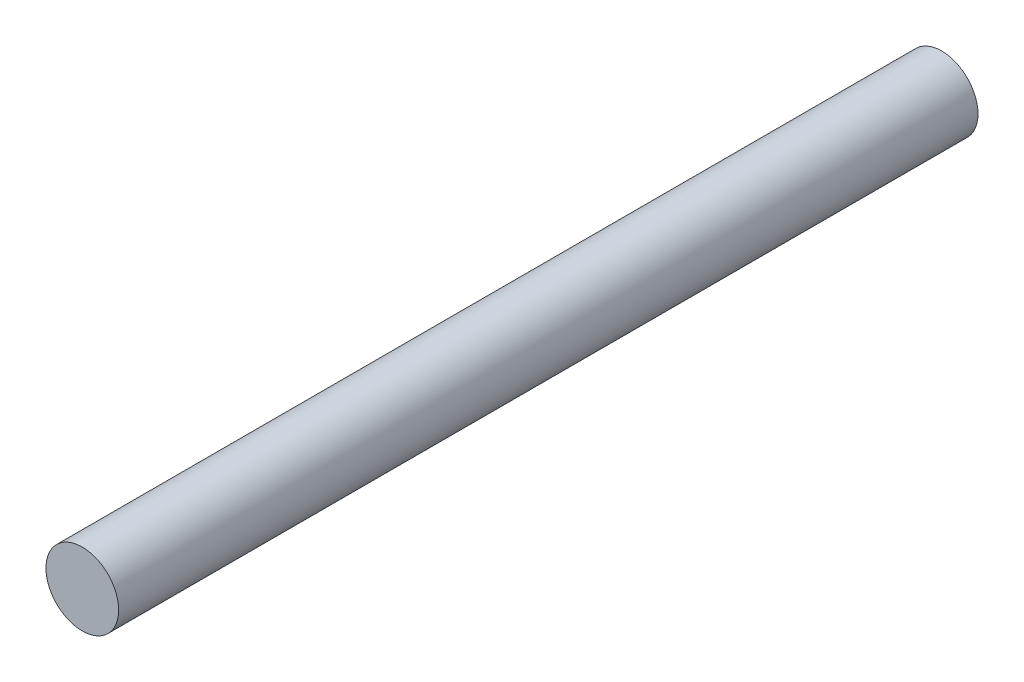
ISO-10303-21;
HEADER;
FILE_DESCRIPTION(('STEP AP214'),'2;1');
FILE_NAME('part.step','',(''),(''),'','','');
FILE_SCHEMA(('AUTOMOTIVE_DESIGN { 1 0 10303 214 1 1 1 1 }'));
ENDSEC;
DATA;
#1=APPLICATION_CONTEXT('core data for automotive mechanical design processes');
#2=APPLICATION_PROTOCOL_DEFINITION('international standard','automotive_design',2000,#1);
#3=PRODUCT_CONTEXT('',#1,'mechanical');
#4=PRODUCT('Part','Part','',(#3));
#5=PRODUCT_RELATED_PRODUCT_CATEGORY('part','',(#4));
#6=PRODUCT_DEFINITION_FORMATION('','',#4);
#7=PRODUCT_DEFINITION_CONTEXT('part definition',#1,'design');
#8=PRODUCT_DEFINITION('design','',#6,#7);
#9=PRODUCT_DEFINITION_SHAPE('','',#8);
#10=(LENGTH_UNIT() NAMED_UNIT(*) SI_UNIT(.MILLI.,.METRE.));
#11=(NAMED_UNIT(*) PLANE_ANGLE_UNIT() SI_UNIT($,.RADIAN.));
#12=(NAMED_UNIT(*) SI_UNIT($,.STERADIAN.) SOLID_ANGLE_UNIT());
#13=UNCERTAINTY_MEASURE_WITH_UNIT(LENGTH_MEASURE(1.E-05),#10,'distance_accuracy_value','');
#14=(GEOMETRIC_REPRESENTATION_CONTEXT(3) GLOBAL_UNCERTAINTY_ASSIGNED_CONTEXT((#13)) GLOBAL_UNIT_ASSIGNED_CONTEXT((#10,
#11,#12)) REPRESENTATION_CONTEXT('',''));
#15=CARTESIAN_POINT('',(0.,0.,0.));
#16=DIRECTION('',(0.,0.,1.));
#17=DIRECTION('',(1.,0.,0.));
#18=AXIS2_PLACEMENT_3D('',#15,#16,#17);
#19=CARTESIAN_POINT('',(-2.67853023562364,-4.21868512110726,130.));
#20=DIRECTION('',(0.,0.,-1.));
#21=DIRECTION('',(-1.,0.,0.));
#22=AXIS2_PLACEMENT_3D('',#19,#20,#21);
#23=CYLINDRICAL_SURFACE('',#22,5.5);
#24=CARTESIAN_POINT('',(-2.67853023562364,-4.21868512110726,130.));
#25=DIRECTION('',(0.,0.,1.));
#26=DIRECTION('',(1.,0.,0.));
#27=AXIS2_PLACEMENT_3D('',#24,#25,#26);
#28=CIRCLE('',#27,5.5);
#29=CARTESIAN_POINT('',(2.82146976437636,-4.21868512110726,130.));
#30=VERTEX_POINT('',#29);
#31=EDGE_CURVE('E10',#30,#30,#28,.T.);
#32=ORIENTED_EDGE('',*,*,#31,.F.);
#33=EDGE_LOOP('',(#32));
#34=FACE_BOUND('',#33,.T.);
#35=CARTESIAN_POINT('',(-2.67853023562364,-4.21868512110726,0.));
#36=DIRECTION('',(0.,0.,1.));
#37=DIRECTION('',(1.,0.,0.));
#38=AXIS2_PLACEMENT_3D('',#35,#36,#37);
#39=CIRCLE('',#38,5.5);
#40=CARTESIAN_POINT('',(2.82146976437636,-4.21868512110726,0.));
#41=VERTEX_POINT('',#40);
#42=EDGE_CURVE('E33',#41,#41,#39,.T.);
#43=ORIENTED_EDGE('',*,*,#42,.T.);
#44=EDGE_LOOP('',(#43));
#45=FACE_BOUND('',#44,.T.);
#46=ADVANCED_FACE('F30',(#34,#45),#23,.T.);
#47=CARTESIAN_POINT('',(-2.67853023562364,-4.21868512110726,130.));
#48=DIRECTION('',(0.,0.,1.));
#49=DIRECTION('',(1.,0.,0.));
#50=AXIS2_PLACEMENT_3D('',#47,#48,#49);
#51=PLANE('',#50);
#52=ORIENTED_EDGE('',*,*,#31,.T.);
#53=EDGE_LOOP('',(#52));
#54=FACE_BOUND('',#53,.T.);
#55=ADVANCED_FACE('F45',(#54),#51,.T.);
#56=CARTESIAN_POINT('',(-2.67853023562364,-4.21868512110726,0.));
#57=DIRECTION('',(0.,0.,1.));
#58=DIRECTION('',(1.,0.,0.));
#59=AXIS2_PLACEMENT_3D('',#56,#57,#58);
#60=PLANE('',#59);
#61=ORIENTED_EDGE('',*,*,#42,.F.);
#62=EDGE_LOOP('',(#61));
#63=FACE_BOUND('',#62,.T.);
#64=ADVANCED_FACE('F43',(#63),#60,.F.);
#65=CLOSED_SHELL('',(#46,#55,#64));
#66=MANIFOLD_SOLID_BREP('B2',#65);
#67=ADVANCED_BREP_SHAPE_REPRESENTATION('',(#18,#66),#14);
#68=SHAPE_DEFINITION_REPRESENTATION(#9,#67);
ENDSEC;
END-ISO-10303-21;
